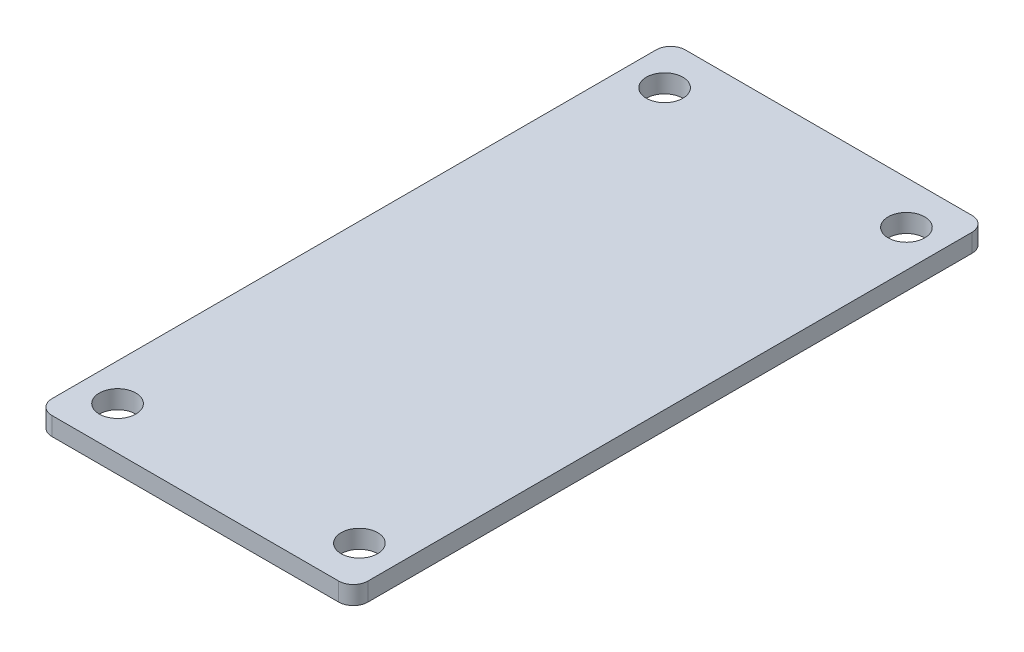
ISO-10303-21;
HEADER;
FILE_DESCRIPTION(('STEP AP214'),'2;1');
FILE_NAME('part.step','',(''),(''),'','','');
FILE_SCHEMA(('AUTOMOTIVE_DESIGN { 1 0 10303 214 1 1 1 1 }'));
ENDSEC;
DATA;
#1=APPLICATION_CONTEXT('core data for automotive mechanical design processes');
#2=APPLICATION_PROTOCOL_DEFINITION('international standard','automotive_design',2000,#1);
#3=PRODUCT_CONTEXT('',#1,'mechanical');
#4=PRODUCT('Part','Part','',(#3));
#5=PRODUCT_RELATED_PRODUCT_CATEGORY('part','',(#4));
#6=PRODUCT_DEFINITION_FORMATION('','',#4);
#7=PRODUCT_DEFINITION_CONTEXT('part definition',#1,'design');
#8=PRODUCT_DEFINITION('design','',#6,#7);
#9=PRODUCT_DEFINITION_SHAPE('','',#8);
#10=(LENGTH_UNIT() NAMED_UNIT(*) SI_UNIT(.MILLI.,.METRE.));
#11=(NAMED_UNIT(*) PLANE_ANGLE_UNIT() SI_UNIT($,.RADIAN.));
#12=(NAMED_UNIT(*) SI_UNIT($,.STERADIAN.) SOLID_ANGLE_UNIT());
#13=UNCERTAINTY_MEASURE_WITH_UNIT(LENGTH_MEASURE(1.E-05),#10,'distance_accuracy_value','');
#14=(GEOMETRIC_REPRESENTATION_CONTEXT(3) GLOBAL_UNCERTAINTY_ASSIGNED_CONTEXT((#13)) GLOBAL_UNIT_ASSIGNED_CONTEXT((#10,
#11,#12)) REPRESENTATION_CONTEXT('',''));
#15=CARTESIAN_POINT('',(0.,0.,0.));
#16=DIRECTION('',(0.,0.,1.));
#17=DIRECTION('',(1.,0.,0.));
#18=AXIS2_PLACEMENT_3D('',#15,#16,#17);
#19=CARTESIAN_POINT('',(0.,-62.865,0.));
#20=DIRECTION('',(0.,-1.,0.));
#21=DIRECTION('',(0.,0.,-1.));
#22=AXIS2_PLACEMENT_3D('',#19,#20,#21);
#23=PLANE('',#22);
#24=CARTESIAN_POINT('',(-112.5593,-62.865,-142.75));
#25=DIRECTION('',(0.,1.,0.));
#26=DIRECTION('',(0.,0.,1.));
#27=AXIS2_PLACEMENT_3D('',#24,#25,#26);
#28=CIRCLE('',#27,3.17499999999998);
#29=CARTESIAN_POINT('',(-112.5593,-62.865,-139.575));
#30=VERTEX_POINT('',#29);
#31=EDGE_CURVE('E198',#30,#30,#28,.T.);
#32=ORIENTED_EDGE('',*,*,#31,.T.);
#33=EDGE_LOOP('',(#32));
#34=FACE_BOUND('',#33,.T.);
#35=CARTESIAN_POINT('',(-154.5593,-62.865,-47.7499999999999));
#36=DIRECTION('',(0.,1.,0.));
#37=DIRECTION('',(0.,0.,1.));
#38=AXIS2_PLACEMENT_3D('',#35,#36,#37);
#39=CIRCLE('',#38,3.175);
#40=CARTESIAN_POINT('',(-154.5593,-62.865,-44.5749999999999));
#41=VERTEX_POINT('',#40);
#42=EDGE_CURVE('E193',#41,#41,#39,.T.);
#43=ORIENTED_EDGE('',*,*,#42,.T.);
#44=EDGE_LOOP('',(#43));
#45=FACE_BOUND('',#44,.T.);
#46=DIRECTION('',(0.,0.,1.));
#47=VECTOR('',#46,1.);
#48=CARTESIAN_POINT('',(-160.9913,-62.865,-150.241));
#49=LINE('',#48,#47);
#50=CARTESIAN_POINT('',(-160.9913,-62.865,-147.701));
#51=VERTEX_POINT('',#50);
#52=CARTESIAN_POINT('',(-160.9913,-62.865,-42.799));
#53=VERTEX_POINT('',#52);
#54=EDGE_CURVE('E125',#51,#53,#49,.T.);
#55=ORIENTED_EDGE('',*,*,#54,.F.);
#56=CARTESIAN_POINT('',(-158.4513,-62.865,-147.701));
#57=DIRECTION('',(0.,-1.,0.));
#58=DIRECTION('',(0.,0.,-1.));
#59=AXIS2_PLACEMENT_3D('',#56,#57,#58);
#60=CIRCLE('',#59,2.54);
#61=CARTESIAN_POINT('',(-158.4513,-62.865,-150.241));
#62=VERTEX_POINT('',#61);
#63=EDGE_CURVE('E232',#51,#62,#60,.T.);
#64=ORIENTED_EDGE('',*,*,#63,.T.);
#65=DIRECTION('',(-1.,0.,0.));
#66=VECTOR('',#65,1.);
#67=CARTESIAN_POINT('',(-106.1273,-62.865,-150.241));
#68=LINE('',#67,#66);
#69=CARTESIAN_POINT('',(-108.6673,-62.865,-150.241));
#70=VERTEX_POINT('',#69);
#71=EDGE_CURVE('E139',#70,#62,#68,.T.);
#72=ORIENTED_EDGE('',*,*,#71,.F.);
#73=CARTESIAN_POINT('',(-108.6673,-62.865,-147.701));
#74=DIRECTION('',(0.,-1.,0.));
#75=DIRECTION('',(0.,0.,-1.));
#76=AXIS2_PLACEMENT_3D('',#73,#74,#75);
#77=CIRCLE('',#76,2.54);
#78=CARTESIAN_POINT('',(-106.1273,-62.865,-147.701));
#79=VERTEX_POINT('',#78);
#80=EDGE_CURVE('E180',#70,#79,#77,.T.);
#81=ORIENTED_EDGE('',*,*,#80,.T.);
#82=DIRECTION('',(0.,0.,-1.));
#83=VECTOR('',#82,1.);
#84=CARTESIAN_POINT('',(-106.1273,-62.865,-150.241));
#85=LINE('',#84,#83);
#86=CARTESIAN_POINT('',(-106.1273,-62.865,-42.799));
#87=VERTEX_POINT('',#86);
#88=EDGE_CURVE('E175',#87,#79,#85,.T.);
#89=ORIENTED_EDGE('',*,*,#88,.F.);
#90=CARTESIAN_POINT('',(-108.6673,-62.865,-42.799));
#91=DIRECTION('',(0.,-1.,0.));
#92=DIRECTION('',(0.,0.,-1.));
#93=AXIS2_PLACEMENT_3D('',#90,#91,#92);
#94=CIRCLE('',#93,2.54);
#95=CARTESIAN_POINT('',(-108.6673,-62.865,-40.259));
#96=VERTEX_POINT('',#95);
#97=EDGE_CURVE('E172',#87,#96,#94,.T.);
#98=ORIENTED_EDGE('',*,*,#97,.T.);
#99=DIRECTION('',(1.,0.,0.));
#100=VECTOR('',#99,1.);
#101=CARTESIAN_POINT('',(-106.1273,-62.865,-40.259));
#102=LINE('',#101,#100);
#103=CARTESIAN_POINT('',(-158.4513,-62.865,-40.259));
#104=VERTEX_POINT('',#103);
#105=EDGE_CURVE('E167',#104,#96,#102,.T.);
#106=ORIENTED_EDGE('',*,*,#105,.F.);
#107=CARTESIAN_POINT('',(-158.4513,-62.865,-42.799));
#108=DIRECTION('',(0.,-1.,0.));
#109=DIRECTION('',(0.,0.,-1.));
#110=AXIS2_PLACEMENT_3D('',#107,#108,#109);
#111=CIRCLE('',#110,2.54);
#112=EDGE_CURVE('E227',#104,#53,#111,.T.);
#113=ORIENTED_EDGE('',*,*,#112,.T.);
#114=EDGE_LOOP('',(#55,#64,#72,#81,#89,#98,#106,#113));
#115=FACE_BOUND('',#114,.T.);
#116=CARTESIAN_POINT('',(-112.5593,-62.865,-47.7499999999999));
#117=DIRECTION('',(0.,1.,0.));
#118=DIRECTION('',(0.,0.,1.));
#119=AXIS2_PLACEMENT_3D('',#116,#117,#118);
#120=CIRCLE('',#119,3.175);
#121=CARTESIAN_POINT('',(-112.5593,-62.865,-44.5749999999999));
#122=VERTEX_POINT('',#121);
#123=EDGE_CURVE('E197',#122,#122,#120,.T.);
#124=ORIENTED_EDGE('',*,*,#123,.T.);
#125=EDGE_LOOP('',(#124));
#126=FACE_BOUND('',#125,.T.);
#127=CARTESIAN_POINT('',(-154.5593,-62.865,-142.75));
#128=DIRECTION('',(0.,1.,0.));
#129=DIRECTION('',(0.,0.,1.));
#130=AXIS2_PLACEMENT_3D('',#127,#128,#129);
#131=CIRCLE('',#130,3.17499999999997);
#132=CARTESIAN_POINT('',(-154.5593,-62.865,-139.575));
#133=VERTEX_POINT('',#132);
#134=EDGE_CURVE('E188',#133,#133,#131,.T.);
#135=ORIENTED_EDGE('',*,*,#134,.T.);
#136=EDGE_LOOP('',(#135));
#137=FACE_BOUND('',#136,.T.);
#138=ADVANCED_FACE('F49',(#34,#45,#115,#126,#137),#23,.T.);
#139=CARTESIAN_POINT('',(-106.1273,63.2168705158504,-150.241));
#140=DIRECTION('',(-1.,0.,0.));
#141=DIRECTION('',(0.,0.,1.));
#142=AXIS2_PLACEMENT_3D('',#139,#140,#141);
#143=PLANE('',#142);
#144=ORIENTED_EDGE('',*,*,#88,.T.);
#145=DIRECTION('',(0.,-1.,0.));
#146=VECTOR('',#145,1.);
#147=CARTESIAN_POINT('',(-106.1273,63.2168705158504,-147.701));
#148=LINE('',#147,#146);
#149=CARTESIAN_POINT('',(-106.1273,-59.69,-147.701));
#150=VERTEX_POINT('',#149);
#151=EDGE_CURVE('E72',#79,#150,#148,.F.);
#152=ORIENTED_EDGE('',*,*,#151,.T.);
#153=DIRECTION('',(0.,0.,1.));
#154=VECTOR('',#153,1.);
#155=CARTESIAN_POINT('',(-106.1273,-59.69,-150.241));
#156=LINE('',#155,#154);
#157=CARTESIAN_POINT('',(-106.1273,-59.69,-42.799));
#158=VERTEX_POINT('',#157);
#159=EDGE_CURVE('E176',#150,#158,#156,.T.);
#160=ORIENTED_EDGE('',*,*,#159,.T.);
#161=DIRECTION('',(0.,-1.,0.));
#162=VECTOR('',#161,1.);
#163=CARTESIAN_POINT('',(-106.1273,63.2168705158504,-42.799));
#164=LINE('',#163,#162);
#165=EDGE_CURVE('E155',#158,#87,#164,.T.);
#166=ORIENTED_EDGE('',*,*,#165,.T.);
#167=EDGE_LOOP('',(#144,#152,#160,#166));
#168=FACE_BOUND('',#167,.T.);
#169=ADVANCED_FACE('F174',(#168),#143,.F.);
#170=CARTESIAN_POINT('',(-106.1273,63.2168705158504,-150.241));
#171=DIRECTION('',(0.,0.,1.));
#172=DIRECTION('',(1.,0.,0.));
#173=AXIS2_PLACEMENT_3D('',#170,#171,#172);
#174=PLANE('',#173);
#175=ORIENTED_EDGE('',*,*,#71,.T.);
#176=DIRECTION('',(0.,-1.,0.));
#177=VECTOR('',#176,1.);
#178=CARTESIAN_POINT('',(-158.4513,63.2168705158504,-150.241));
#179=LINE('',#178,#177);
#180=CARTESIAN_POINT('',(-158.4513,-59.69,-150.241));
#181=VERTEX_POINT('',#180);
#182=EDGE_CURVE('E149',#62,#181,#179,.F.);
#183=ORIENTED_EDGE('',*,*,#182,.T.);
#184=DIRECTION('',(1.,0.,0.));
#185=VECTOR('',#184,1.);
#186=CARTESIAN_POINT('',(-106.1273,-59.69,-150.241));
#187=LINE('',#186,#185);
#188=CARTESIAN_POINT('',(-108.6673,-59.69,-150.241));
#189=VERTEX_POINT('',#188);
#190=EDGE_CURVE('E182',#181,#189,#187,.T.);
#191=ORIENTED_EDGE('',*,*,#190,.T.);
#192=DIRECTION('',(0.,-1.,0.));
#193=VECTOR('',#192,1.);
#194=CARTESIAN_POINT('',(-108.6673,63.2168705158504,-150.241));
#195=LINE('',#194,#193);
#196=EDGE_CURVE('E235',#189,#70,#195,.T.);
#197=ORIENTED_EDGE('',*,*,#196,.T.);
#198=EDGE_LOOP('',(#175,#183,#191,#197));
#199=FACE_BOUND('',#198,.T.);
#200=ADVANCED_FACE('F242',(#199),#174,.F.);
#201=CARTESIAN_POINT('',(-160.9913,63.2168705158504,-150.241));
#202=DIRECTION('',(1.,0.,0.));
#203=DIRECTION('',(0.,0.,-1.));
#204=AXIS2_PLACEMENT_3D('',#201,#202,#203);
#205=PLANE('',#204);
#206=DIRECTION('',(0.,0.,-1.));
#207=VECTOR('',#206,1.);
#208=CARTESIAN_POINT('',(-160.9913,-59.69,-150.241));
#209=LINE('',#208,#207);
#210=CARTESIAN_POINT('',(-160.9913,-59.69,-42.799));
#211=VERTEX_POINT('',#210);
#212=CARTESIAN_POINT('',(-160.9913,-59.69,-147.701));
#213=VERTEX_POINT('',#212);
#214=EDGE_CURVE('E122',#211,#213,#209,.T.);
#215=ORIENTED_EDGE('',*,*,#214,.T.);
#216=DIRECTION('',(0.,-1.,0.));
#217=VECTOR('',#216,1.);
#218=CARTESIAN_POINT('',(-160.9913,63.2168705158504,-147.701));
#219=LINE('',#218,#217);
#220=EDGE_CURVE('E129',#213,#51,#219,.T.);
#221=ORIENTED_EDGE('',*,*,#220,.T.);
#222=ORIENTED_EDGE('',*,*,#54,.T.);
#223=DIRECTION('',(0.,-1.,0.));
#224=VECTOR('',#223,1.);
#225=CARTESIAN_POINT('',(-160.9913,63.2168705158504,-42.799));
#226=LINE('',#225,#224);
#227=EDGE_CURVE('E118',#53,#211,#226,.F.);
#228=ORIENTED_EDGE('',*,*,#227,.T.);
#229=EDGE_LOOP('',(#215,#221,#222,#228));
#230=FACE_BOUND('',#229,.T.);
#231=ADVANCED_FACE('F120',(#230),#205,.F.);
#232=CARTESIAN_POINT('',(-106.1273,63.2168705158504,-40.259));
#233=DIRECTION('',(0.,0.,-1.));
#234=DIRECTION('',(-1.,0.,0.));
#235=AXIS2_PLACEMENT_3D('',#232,#233,#234);
#236=PLANE('',#235);
#237=DIRECTION('',(-1.,0.,0.));
#238=VECTOR('',#237,1.);
#239=CARTESIAN_POINT('',(-106.1273,-59.69,-40.259));
#240=LINE('',#239,#238);
#241=CARTESIAN_POINT('',(-108.6673,-59.69,-40.259));
#242=VERTEX_POINT('',#241);
#243=CARTESIAN_POINT('',(-158.4513,-59.69,-40.259));
#244=VERTEX_POINT('',#243);
#245=EDGE_CURVE('E165',#242,#244,#240,.T.);
#246=ORIENTED_EDGE('',*,*,#245,.T.);
#247=DIRECTION('',(0.,-1.,0.));
#248=VECTOR('',#247,1.);
#249=CARTESIAN_POINT('',(-158.4513,63.2168705158504,-40.259));
#250=LINE('',#249,#248);
#251=EDGE_CURVE('E11',#244,#104,#250,.T.);
#252=ORIENTED_EDGE('',*,*,#251,.T.);
#253=ORIENTED_EDGE('',*,*,#105,.T.);
#254=DIRECTION('',(0.,-1.,0.));
#255=VECTOR('',#254,1.);
#256=CARTESIAN_POINT('',(-108.6673,63.2168705158504,-40.259));
#257=LINE('',#256,#255);
#258=EDGE_CURVE('E58',#96,#242,#257,.F.);
#259=ORIENTED_EDGE('',*,*,#258,.T.);
#260=EDGE_LOOP('',(#246,#252,#253,#259));
#261=FACE_BOUND('',#260,.T.);
#262=ADVANCED_FACE('F164',(#261),#236,.F.);
#263=CARTESIAN_POINT('',(-154.5593,63.2168705158504,-47.7499999999999));
#264=DIRECTION('',(0.,-1.,0.));
#265=DIRECTION('',(0.,0.,-1.));
#266=AXIS2_PLACEMENT_3D('',#263,#264,#265);
#267=CYLINDRICAL_SURFACE('',#266,3.175);
#268=CARTESIAN_POINT('',(-154.5593,-59.69,-47.7499999999999));
#269=DIRECTION('',(0.,-1.,0.));
#270=DIRECTION('',(0.,0.,-1.));
#271=AXIS2_PLACEMENT_3D('',#268,#269,#270);
#272=CIRCLE('',#271,3.175);
#273=CARTESIAN_POINT('',(-154.5593,-59.69,-50.9249999999999));
#274=VERTEX_POINT('',#273);
#275=EDGE_CURVE('E130',#274,#274,#272,.T.);
#276=ORIENTED_EDGE('',*,*,#275,.F.);
#277=EDGE_LOOP('',(#276));
#278=FACE_BOUND('',#277,.T.);
#279=ORIENTED_EDGE('',*,*,#42,.F.);
#280=EDGE_LOOP('',(#279));
#281=FACE_BOUND('',#280,.T.);
#282=ADVANCED_FACE('F280',(#278,#281),#267,.F.);
#283=CARTESIAN_POINT('',(-112.5593,63.2168705158504,-47.7499999999999));
#284=DIRECTION('',(0.,-1.,0.));
#285=DIRECTION('',(0.,0.,-1.));
#286=AXIS2_PLACEMENT_3D('',#283,#284,#285);
#287=CYLINDRICAL_SURFACE('',#286,3.175);
#288=CARTESIAN_POINT('',(-112.5593,-59.69,-47.7499999999999));
#289=DIRECTION('',(0.,-1.,0.));
#290=DIRECTION('',(0.,0.,-1.));
#291=AXIS2_PLACEMENT_3D('',#288,#289,#290);
#292=CIRCLE('',#291,3.175);
#293=CARTESIAN_POINT('',(-112.5593,-59.69,-50.9249999999999));
#294=VERTEX_POINT('',#293);
#295=EDGE_CURVE('E211',#294,#294,#292,.T.);
#296=ORIENTED_EDGE('',*,*,#295,.F.);
#297=EDGE_LOOP('',(#296));
#298=FACE_BOUND('',#297,.T.);
#299=ORIENTED_EDGE('',*,*,#123,.F.);
#300=EDGE_LOOP('',(#299));
#301=FACE_BOUND('',#300,.T.);
#302=ADVANCED_FACE('F276',(#298,#301),#287,.F.);
#303=CARTESIAN_POINT('',(-112.5593,63.2168705158504,-142.75));
#304=DIRECTION('',(0.,-1.,0.));
#305=DIRECTION('',(0.,0.,-1.));
#306=AXIS2_PLACEMENT_3D('',#303,#304,#305);
#307=CYLINDRICAL_SURFACE('',#306,3.17499999999998);
#308=CARTESIAN_POINT('',(-112.5593,-59.69,-142.75));
#309=DIRECTION('',(0.,-1.,0.));
#310=DIRECTION('',(0.,0.,-1.));
#311=AXIS2_PLACEMENT_3D('',#308,#309,#310);
#312=CIRCLE('',#311,3.17499999999998);
#313=CARTESIAN_POINT('',(-112.5593,-59.69,-145.925));
#314=VERTEX_POINT('',#313);
#315=EDGE_CURVE('E215',#314,#314,#312,.T.);
#316=ORIENTED_EDGE('',*,*,#315,.F.);
#317=EDGE_LOOP('',(#316));
#318=FACE_BOUND('',#317,.T.);
#319=ORIENTED_EDGE('',*,*,#31,.F.);
#320=EDGE_LOOP('',(#319));
#321=FACE_BOUND('',#320,.T.);
#322=ADVANCED_FACE('F273',(#318,#321),#307,.F.);
#323=CARTESIAN_POINT('',(-154.5593,63.2168705158504,-142.75));
#324=DIRECTION('',(0.,-1.,0.));
#325=DIRECTION('',(0.,0.,-1.));
#326=AXIS2_PLACEMENT_3D('',#323,#324,#325);
#327=CYLINDRICAL_SURFACE('',#326,3.17499999999997);
#328=CARTESIAN_POINT('',(-154.5593,-59.69,-142.75));
#329=DIRECTION('',(0.,-1.,0.));
#330=DIRECTION('',(0.,0.,-1.));
#331=AXIS2_PLACEMENT_3D('',#328,#329,#330);
#332=CIRCLE('',#331,3.17499999999997);
#333=CARTESIAN_POINT('',(-154.5593,-59.69,-145.925));
#334=VERTEX_POINT('',#333);
#335=EDGE_CURVE('E219',#334,#334,#332,.T.);
#336=ORIENTED_EDGE('',*,*,#335,.F.);
#337=EDGE_LOOP('',(#336));
#338=FACE_BOUND('',#337,.T.);
#339=ORIENTED_EDGE('',*,*,#134,.F.);
#340=EDGE_LOOP('',(#339));
#341=FACE_BOUND('',#340,.T.);
#342=ADVANCED_FACE('F260',(#338,#341),#327,.F.);
#343=CARTESIAN_POINT('',(-193.5033,-59.69,-69.85));
#344=DIRECTION('',(0.,-1.,0.));
#345=DIRECTION('',(0.,0.,-1.));
#346=AXIS2_PLACEMENT_3D('',#343,#344,#345);
#347=PLANE('',#346);
#348=ORIENTED_EDGE('',*,*,#335,.T.);
#349=EDGE_LOOP('',(#348));
#350=FACE_BOUND('',#349,.T.);
#351=ORIENTED_EDGE('',*,*,#315,.T.);
#352=EDGE_LOOP('',(#351));
#353=FACE_BOUND('',#352,.T.);
#354=ORIENTED_EDGE('',*,*,#295,.T.);
#355=EDGE_LOOP('',(#354));
#356=FACE_BOUND('',#355,.T.);
#357=ORIENTED_EDGE('',*,*,#275,.T.);
#358=EDGE_LOOP('',(#357));
#359=FACE_BOUND('',#358,.T.);
#360=ORIENTED_EDGE('',*,*,#190,.F.);
#361=CARTESIAN_POINT('',(-158.4513,-59.69,-147.701));
#362=DIRECTION('',(0.,-1.,0.));
#363=DIRECTION('',(0.,0.,-1.));
#364=AXIS2_PLACEMENT_3D('',#361,#362,#363);
#365=CIRCLE('',#364,2.54);
#366=EDGE_CURVE('E137',#181,#213,#365,.F.);
#367=ORIENTED_EDGE('',*,*,#366,.T.);
#368=ORIENTED_EDGE('',*,*,#214,.F.);
#369=CARTESIAN_POINT('',(-158.4513,-59.69,-42.799));
#370=DIRECTION('',(0.,-1.,0.));
#371=DIRECTION('',(0.,0.,-1.));
#372=AXIS2_PLACEMENT_3D('',#369,#370,#371);
#373=CIRCLE('',#372,2.54);
#374=EDGE_CURVE('E134',#211,#244,#373,.F.);
#375=ORIENTED_EDGE('',*,*,#374,.T.);
#376=ORIENTED_EDGE('',*,*,#245,.F.);
#377=CARTESIAN_POINT('',(-108.6673,-59.69,-42.799));
#378=DIRECTION('',(0.,-1.,0.));
#379=DIRECTION('',(0.,0.,-1.));
#380=AXIS2_PLACEMENT_3D('',#377,#378,#379);
#381=CIRCLE('',#380,2.54);
#382=EDGE_CURVE('E65',#242,#158,#381,.F.);
#383=ORIENTED_EDGE('',*,*,#382,.T.);
#384=ORIENTED_EDGE('',*,*,#159,.F.);
#385=CARTESIAN_POINT('',(-108.6673,-59.69,-147.701));
#386=DIRECTION('',(0.,-1.,0.));
#387=DIRECTION('',(0.,0.,-1.));
#388=AXIS2_PLACEMENT_3D('',#385,#386,#387);
#389=CIRCLE('',#388,2.54);
#390=EDGE_CURVE('E144',#150,#189,#389,.F.);
#391=ORIENTED_EDGE('',*,*,#390,.T.);
#392=EDGE_LOOP('',(#360,#367,#368,#375,#376,#383,#384,#391));
#393=FACE_BOUND('',#392,.T.);
#394=ADVANCED_FACE('F133',(#350,#353,#356,#359,#393),#347,.F.);
#395=CARTESIAN_POINT('',(-158.4513,63.2168705158504,-147.701));
#396=DIRECTION('',(0.,-1.,0.));
#397=DIRECTION('',(0.,0.,-1.));
#398=AXIS2_PLACEMENT_3D('',#395,#396,#397);
#399=CYLINDRICAL_SURFACE('',#398,2.54);
#400=ORIENTED_EDGE('',*,*,#366,.F.);
#401=ORIENTED_EDGE('',*,*,#182,.F.);
#402=ORIENTED_EDGE('',*,*,#63,.F.);
#403=ORIENTED_EDGE('',*,*,#220,.F.);
#404=EDGE_LOOP('',(#400,#401,#402,#403));
#405=FACE_BOUND('',#404,.T.);
#406=ADVANCED_FACE('F246',(#405),#399,.T.);
#407=CARTESIAN_POINT('',(-108.6673,63.2168705158504,-147.701));
#408=DIRECTION('',(0.,-1.,0.));
#409=DIRECTION('',(0.,0.,-1.));
#410=AXIS2_PLACEMENT_3D('',#407,#408,#409);
#411=CYLINDRICAL_SURFACE('',#410,2.54);
#412=ORIENTED_EDGE('',*,*,#390,.F.);
#413=ORIENTED_EDGE('',*,*,#151,.F.);
#414=ORIENTED_EDGE('',*,*,#80,.F.);
#415=ORIENTED_EDGE('',*,*,#196,.F.);
#416=EDGE_LOOP('',(#412,#413,#414,#415));
#417=FACE_BOUND('',#416,.T.);
#418=ADVANCED_FACE('F252',(#417),#411,.T.);
#419=CARTESIAN_POINT('',(-158.4513,63.2168705158504,-42.799));
#420=DIRECTION('',(0.,-1.,0.));
#421=DIRECTION('',(0.,0.,-1.));
#422=AXIS2_PLACEMENT_3D('',#419,#420,#421);
#423=CYLINDRICAL_SURFACE('',#422,2.54);
#424=ORIENTED_EDGE('',*,*,#374,.F.);
#425=ORIENTED_EDGE('',*,*,#227,.F.);
#426=ORIENTED_EDGE('',*,*,#112,.F.);
#427=ORIENTED_EDGE('',*,*,#251,.F.);
#428=EDGE_LOOP('',(#424,#425,#426,#427));
#429=FACE_BOUND('',#428,.T.);
#430=ADVANCED_FACE('F142',(#429),#423,.T.);
#431=CARTESIAN_POINT('',(-108.6673,63.2168705158504,-42.799));
#432=DIRECTION('',(0.,-1.,0.));
#433=DIRECTION('',(0.,0.,-1.));
#434=AXIS2_PLACEMENT_3D('',#431,#432,#433);
#435=CYLINDRICAL_SURFACE('',#434,2.54);
#436=ORIENTED_EDGE('',*,*,#382,.F.);
#437=ORIENTED_EDGE('',*,*,#258,.F.);
#438=ORIENTED_EDGE('',*,*,#97,.F.);
#439=ORIENTED_EDGE('',*,*,#165,.F.);
#440=EDGE_LOOP('',(#436,#437,#438,#439));
#441=FACE_BOUND('',#440,.T.);
#442=ADVANCED_FACE('F51',(#441),#435,.T.);
#443=CLOSED_SHELL('',(#138,#169,#200,#231,#262,#282,#302,#322,#342,#394,#406,#418,#430,#442));
#444=MANIFOLD_SOLID_BREP('B2',#443);
#445=ADVANCED_BREP_SHAPE_REPRESENTATION('',(#18,#444),#14);
#446=SHAPE_DEFINITION_REPRESENTATION(#9,#445);
ENDSEC;
END-ISO-10303-21;
